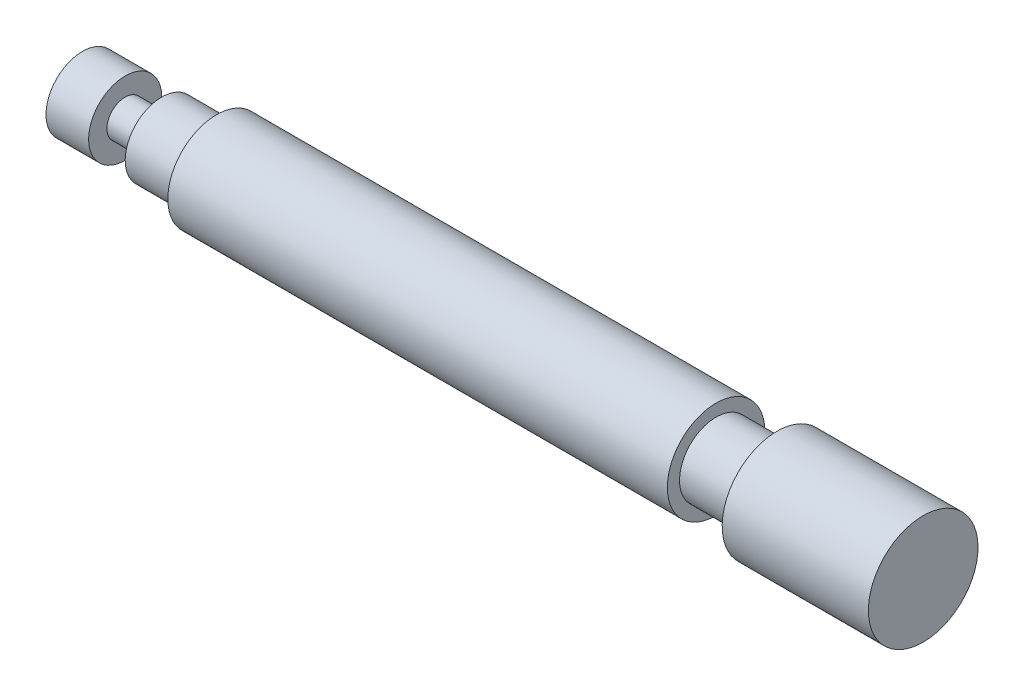
ISO-10303-21;
HEADER;
FILE_DESCRIPTION(('STEP AP214'),'2;1');
FILE_NAME('part.step','',(''),(''),'','','');
FILE_SCHEMA(('AUTOMOTIVE_DESIGN { 1 0 10303 214 1 1 1 1 }'));
ENDSEC;
DATA;
#1=APPLICATION_CONTEXT('core data for automotive mechanical design processes');
#2=APPLICATION_PROTOCOL_DEFINITION('international standard','automotive_design',2000,#1);
#3=PRODUCT_CONTEXT('',#1,'mechanical');
#4=PRODUCT('Part','Part','',(#3));
#5=PRODUCT_RELATED_PRODUCT_CATEGORY('part','',(#4));
#6=PRODUCT_DEFINITION_FORMATION('','',#4);
#7=PRODUCT_DEFINITION_CONTEXT('part definition',#1,'design');
#8=PRODUCT_DEFINITION('design','',#6,#7);
#9=PRODUCT_DEFINITION_SHAPE('','',#8);
#10=(LENGTH_UNIT() NAMED_UNIT(*) SI_UNIT(.MILLI.,.METRE.));
#11=(NAMED_UNIT(*) PLANE_ANGLE_UNIT() SI_UNIT($,.RADIAN.));
#12=(NAMED_UNIT(*) SI_UNIT($,.STERADIAN.) SOLID_ANGLE_UNIT());
#13=UNCERTAINTY_MEASURE_WITH_UNIT(LENGTH_MEASURE(1.E-05),#10,'distance_accuracy_value','');
#14=(GEOMETRIC_REPRESENTATION_CONTEXT(3) GLOBAL_UNCERTAINTY_ASSIGNED_CONTEXT((#13)) GLOBAL_UNIT_ASSIGNED_CONTEXT((#10,
#11,#12)) REPRESENTATION_CONTEXT('',''));
#15=CARTESIAN_POINT('',(0.,0.,0.));
#16=DIRECTION('',(0.,0.,1.));
#17=DIRECTION('',(1.,0.,0.));
#18=AXIS2_PLACEMENT_3D('',#15,#16,#17);
#19=CARTESIAN_POINT('',(69.,0.,0.));
#20=DIRECTION('',(-1.,0.,0.));
#21=DIRECTION('',(0.,-1.,0.));
#22=AXIS2_PLACEMENT_3D('',#19,#20,#21);
#23=PLANE('',#22);
#24=CARTESIAN_POINT('',(69.,0.,0.));
#25=DIRECTION('',(-1.,0.,0.));
#26=DIRECTION('',(0.,-1.,0.));
#27=AXIS2_PLACEMENT_3D('',#24,#25,#26);
#28=CIRCLE('',#27,9.);
#29=CARTESIAN_POINT('',(69.,-8.99999999999997,0.));
#30=VERTEX_POINT('',#29);
#31=EDGE_CURVE('E10',#30,#30,#28,.T.);
#32=ORIENTED_EDGE('',*,*,#31,.F.);
#33=EDGE_LOOP('',(#32));
#34=FACE_BOUND('',#33,.T.);
#35=ADVANCED_FACE('F31',(#34),#23,.F.);
#36=CARTESIAN_POINT('',(-69.,0.,0.));
#37=DIRECTION('',(-1.,0.,0.));
#38=DIRECTION('',(0.,-1.,0.));
#39=AXIS2_PLACEMENT_3D('',#36,#37,#38);
#40=CYLINDRICAL_SURFACE('',#39,9.);
#41=CARTESIAN_POINT('',(45.,0.,0.));
#42=DIRECTION('',(-1.,0.,0.));
#43=DIRECTION('',(0.,-1.,0.));
#44=AXIS2_PLACEMENT_3D('',#41,#42,#43);
#45=CIRCLE('',#44,9.);
#46=CARTESIAN_POINT('',(45.,-8.99999999999998,0.));
#47=VERTEX_POINT('',#46);
#48=EDGE_CURVE('E37',#47,#47,#45,.T.);
#49=ORIENTED_EDGE('',*,*,#48,.F.);
#50=EDGE_LOOP('',(#49));
#51=FACE_BOUND('',#50,.T.);
#52=ORIENTED_EDGE('',*,*,#31,.T.);
#53=EDGE_LOOP('',(#52));
#54=FACE_BOUND('',#53,.T.);
#55=ADVANCED_FACE('F133',(#51,#54),#40,.T.);
#56=CARTESIAN_POINT('',(45.,5.99999999999999,0.));
#57=DIRECTION('',(1.,0.,0.));
#58=DIRECTION('',(0.,1.,0.));
#59=AXIS2_PLACEMENT_3D('',#56,#57,#58);
#60=PLANE('',#59);
#61=CARTESIAN_POINT('',(45.,0.,0.));
#62=DIRECTION('',(-1.,0.,0.));
#63=DIRECTION('',(0.,-1.,0.));
#64=AXIS2_PLACEMENT_3D('',#61,#62,#63);
#65=CIRCLE('',#64,5.99999999999997);
#66=CARTESIAN_POINT('',(45.,-5.99999999999995,0.));
#67=VERTEX_POINT('',#66);
#68=EDGE_CURVE('E41',#67,#67,#65,.T.);
#69=ORIENTED_EDGE('',*,*,#68,.F.);
#70=EDGE_LOOP('',(#69));
#71=FACE_BOUND('',#70,.T.);
#72=ORIENTED_EDGE('',*,*,#48,.T.);
#73=EDGE_LOOP('',(#72));
#74=FACE_BOUND('',#73,.T.);
#75=ADVANCED_FACE('F128',(#71,#74),#60,.F.);
#76=CARTESIAN_POINT('',(-69.,0.,0.));
#77=DIRECTION('',(-1.,0.,0.));
#78=DIRECTION('',(0.,-1.,0.));
#79=AXIS2_PLACEMENT_3D('',#76,#77,#78);
#80=CYLINDRICAL_SURFACE('',#79,5.99999999999997);
#81=CARTESIAN_POINT('',(35.,0.,0.));
#82=DIRECTION('',(-1.,0.,0.));
#83=DIRECTION('',(0.,-1.,0.));
#84=AXIS2_PLACEMENT_3D('',#81,#82,#83);
#85=CIRCLE('',#84,5.99999999999997);
#86=CARTESIAN_POINT('',(35.,-5.99999999999995,0.));
#87=VERTEX_POINT('',#86);
#88=EDGE_CURVE('E45',#87,#87,#85,.T.);
#89=ORIENTED_EDGE('',*,*,#88,.F.);
#90=EDGE_LOOP('',(#89));
#91=FACE_BOUND('',#90,.T.);
#92=ORIENTED_EDGE('',*,*,#68,.T.);
#93=EDGE_LOOP('',(#92));
#94=FACE_BOUND('',#93,.T.);
#95=ADVANCED_FACE('F122',(#91,#94),#80,.T.);
#96=CARTESIAN_POINT('',(35.,7.99999999999999,0.));
#97=DIRECTION('',(-1.,0.,0.));
#98=DIRECTION('',(0.,-1.,0.));
#99=AXIS2_PLACEMENT_3D('',#96,#97,#98);
#100=PLANE('',#99);
#101=CARTESIAN_POINT('',(35.,0.,0.));
#102=DIRECTION('',(-1.,0.,0.));
#103=DIRECTION('',(0.,-1.,0.));
#104=AXIS2_PLACEMENT_3D('',#101,#102,#103);
#105=CIRCLE('',#104,7.99999999999997);
#106=CARTESIAN_POINT('',(35.,-7.99999999999995,0.));
#107=VERTEX_POINT('',#106);
#108=EDGE_CURVE('E50',#107,#107,#105,.T.);
#109=ORIENTED_EDGE('',*,*,#108,.F.);
#110=EDGE_LOOP('',(#109));
#111=FACE_BOUND('',#110,.T.);
#112=ORIENTED_EDGE('',*,*,#88,.T.);
#113=EDGE_LOOP('',(#112));
#114=FACE_BOUND('',#113,.T.);
#115=ADVANCED_FACE('F116',(#111,#114),#100,.F.);
#116=CARTESIAN_POINT('',(-69.,0.,0.));
#117=DIRECTION('',(-1.,0.,0.));
#118=DIRECTION('',(0.,-1.,0.));
#119=AXIS2_PLACEMENT_3D('',#116,#117,#118);
#120=CYLINDRICAL_SURFACE('',#119,7.99999999999998);
#121=CARTESIAN_POINT('',(-47.,0.,0.));
#122=DIRECTION('',(-1.,0.,0.));
#123=DIRECTION('',(0.,-1.,0.));
#124=AXIS2_PLACEMENT_3D('',#121,#122,#123);
#125=CIRCLE('',#124,7.99999999999999);
#126=CARTESIAN_POINT('',(-47.,-7.99999999999999,0.));
#127=VERTEX_POINT('',#126);
#128=EDGE_CURVE('E53',#127,#127,#125,.T.);
#129=ORIENTED_EDGE('',*,*,#128,.F.);
#130=EDGE_LOOP('',(#129));
#131=FACE_BOUND('',#130,.T.);
#132=ORIENTED_EDGE('',*,*,#108,.T.);
#133=EDGE_LOOP('',(#132));
#134=FACE_BOUND('',#133,.T.);
#135=ADVANCED_FACE('F110',(#131,#134),#120,.T.);
#136=CARTESIAN_POINT('',(-47.,6.,0.));
#137=DIRECTION('',(1.,0.,0.));
#138=DIRECTION('',(0.,1.,0.));
#139=AXIS2_PLACEMENT_3D('',#136,#137,#138);
#140=PLANE('',#139);
#141=CARTESIAN_POINT('',(-47.,0.,0.));
#142=DIRECTION('',(-1.,0.,0.));
#143=DIRECTION('',(0.,-1.,0.));
#144=AXIS2_PLACEMENT_3D('',#141,#142,#143);
#145=CIRCLE('',#144,6.);
#146=CARTESIAN_POINT('',(-47.,-5.99999999999999,0.));
#147=VERTEX_POINT('',#146);
#148=EDGE_CURVE('E56',#147,#147,#145,.T.);
#149=ORIENTED_EDGE('',*,*,#148,.F.);
#150=EDGE_LOOP('',(#149));
#151=FACE_BOUND('',#150,.T.);
#152=ORIENTED_EDGE('',*,*,#128,.T.);
#153=EDGE_LOOP('',(#152));
#154=FACE_BOUND('',#153,.T.);
#155=ADVANCED_FACE('F104',(#151,#154),#140,.F.);
#156=CARTESIAN_POINT('',(-69.,0.,0.));
#157=DIRECTION('',(-1.,0.,0.));
#158=DIRECTION('',(0.,-1.,0.));
#159=AXIS2_PLACEMENT_3D('',#156,#157,#158);
#160=CYLINDRICAL_SURFACE('',#159,6.);
#161=CARTESIAN_POINT('',(-56.,0.,0.));
#162=DIRECTION('',(-1.,0.,0.));
#163=DIRECTION('',(0.,-1.,0.));
#164=AXIS2_PLACEMENT_3D('',#161,#162,#163);
#165=CIRCLE('',#164,6.);
#166=CARTESIAN_POINT('',(-56.,-5.99999999999999,0.));
#167=VERTEX_POINT('',#166);
#168=EDGE_CURVE('E59',#167,#167,#165,.T.);
#169=ORIENTED_EDGE('',*,*,#168,.F.);
#170=EDGE_LOOP('',(#169));
#171=FACE_BOUND('',#170,.T.);
#172=ORIENTED_EDGE('',*,*,#148,.T.);
#173=EDGE_LOOP('',(#172));
#174=FACE_BOUND('',#173,.T.);
#175=ADVANCED_FACE('F98',(#171,#174),#160,.T.);
#176=CARTESIAN_POINT('',(-56.,3.,0.));
#177=DIRECTION('',(1.,0.,0.));
#178=DIRECTION('',(0.,1.,0.));
#179=AXIS2_PLACEMENT_3D('',#176,#177,#178);
#180=PLANE('',#179);
#181=CARTESIAN_POINT('',(-56.,0.,0.));
#182=DIRECTION('',(-1.,0.,0.));
#183=DIRECTION('',(0.,-1.,0.));
#184=AXIS2_PLACEMENT_3D('',#181,#182,#183);
#185=CIRCLE('',#184,3.);
#186=CARTESIAN_POINT('',(-56.,-3.,0.));
#187=VERTEX_POINT('',#186);
#188=EDGE_CURVE('E62',#187,#187,#185,.T.);
#189=ORIENTED_EDGE('',*,*,#188,.F.);
#190=EDGE_LOOP('',(#189));
#191=FACE_BOUND('',#190,.T.);
#192=ORIENTED_EDGE('',*,*,#168,.T.);
#193=EDGE_LOOP('',(#192));
#194=FACE_BOUND('',#193,.T.);
#195=ADVANCED_FACE('F92',(#191,#194),#180,.F.);
#196=CARTESIAN_POINT('',(-69.,0.,0.));
#197=DIRECTION('',(-1.,0.,0.));
#198=DIRECTION('',(0.,-1.,0.));
#199=AXIS2_PLACEMENT_3D('',#196,#197,#198);
#200=CYLINDRICAL_SURFACE('',#199,3.);
#201=CARTESIAN_POINT('',(-62.,0.,0.));
#202=DIRECTION('',(-1.,0.,0.));
#203=DIRECTION('',(0.,-1.,0.));
#204=AXIS2_PLACEMENT_3D('',#201,#202,#203);
#205=CIRCLE('',#204,3.);
#206=CARTESIAN_POINT('',(-62.,-3.,0.));
#207=VERTEX_POINT('',#206);
#208=EDGE_CURVE('E65',#207,#207,#205,.T.);
#209=ORIENTED_EDGE('',*,*,#208,.F.);
#210=EDGE_LOOP('',(#209));
#211=FACE_BOUND('',#210,.T.);
#212=ORIENTED_EDGE('',*,*,#188,.T.);
#213=EDGE_LOOP('',(#212));
#214=FACE_BOUND('',#213,.T.);
#215=ADVANCED_FACE('F86',(#211,#214),#200,.T.);
#216=CARTESIAN_POINT('',(-62.,6.,0.));
#217=DIRECTION('',(-1.,0.,0.));
#218=DIRECTION('',(0.,-1.,0.));
#219=AXIS2_PLACEMENT_3D('',#216,#217,#218);
#220=PLANE('',#219);
#221=CARTESIAN_POINT('',(-62.,0.,0.));
#222=DIRECTION('',(-1.,0.,0.));
#223=DIRECTION('',(0.,-1.,0.));
#224=AXIS2_PLACEMENT_3D('',#221,#222,#223);
#225=CIRCLE('',#224,6.);
#226=CARTESIAN_POINT('',(-62.,-6.,0.));
#227=VERTEX_POINT('',#226);
#228=EDGE_CURVE('E68',#227,#227,#225,.T.);
#229=ORIENTED_EDGE('',*,*,#228,.F.);
#230=EDGE_LOOP('',(#229));
#231=FACE_BOUND('',#230,.T.);
#232=ORIENTED_EDGE('',*,*,#208,.T.);
#233=EDGE_LOOP('',(#232));
#234=FACE_BOUND('',#233,.T.);
#235=ADVANCED_FACE('F80',(#231,#234),#220,.F.);
#236=CARTESIAN_POINT('',(-69.,0.,0.));
#237=DIRECTION('',(-1.,0.,0.));
#238=DIRECTION('',(0.,-1.,0.));
#239=AXIS2_PLACEMENT_3D('',#236,#237,#238);
#240=CYLINDRICAL_SURFACE('',#239,6.);
#241=CARTESIAN_POINT('',(-69.,0.,0.));
#242=DIRECTION('',(-1.,0.,0.));
#243=DIRECTION('',(0.,-1.,0.));
#244=AXIS2_PLACEMENT_3D('',#241,#242,#243);
#245=CIRCLE('',#244,6.);
#246=CARTESIAN_POINT('',(-69.,-6.,0.));
#247=VERTEX_POINT('',#246);
#248=EDGE_CURVE('E71',#247,#247,#245,.T.);
#249=ORIENTED_EDGE('',*,*,#248,.F.);
#250=EDGE_LOOP('',(#249));
#251=FACE_BOUND('',#250,.T.);
#252=ORIENTED_EDGE('',*,*,#228,.T.);
#253=EDGE_LOOP('',(#252));
#254=FACE_BOUND('',#253,.T.);
#255=ADVANCED_FACE('F77',(#251,#254),#240,.T.);
#256=CARTESIAN_POINT('',(-69.,0.,0.));
#257=DIRECTION('',(1.,0.,0.));
#258=DIRECTION('',(0.,1.,0.));
#259=AXIS2_PLACEMENT_3D('',#256,#257,#258);
#260=PLANE('',#259);
#261=ORIENTED_EDGE('',*,*,#248,.T.);
#262=EDGE_LOOP('',(#261));
#263=FACE_BOUND('',#262,.T.);
#264=ADVANCED_FACE('F75',(#263),#260,.F.);
#265=CLOSED_SHELL('',(#35,#55,#75,#95,#115,#135,#155,#175,#195,#215,#235,#255,#264));
#266=MANIFOLD_SOLID_BREP('B2',#265);
#267=ADVANCED_BREP_SHAPE_REPRESENTATION('',(#18,#266),#14);
#268=SHAPE_DEFINITION_REPRESENTATION(#9,#267);
ENDSEC;
END-ISO-10303-21;
